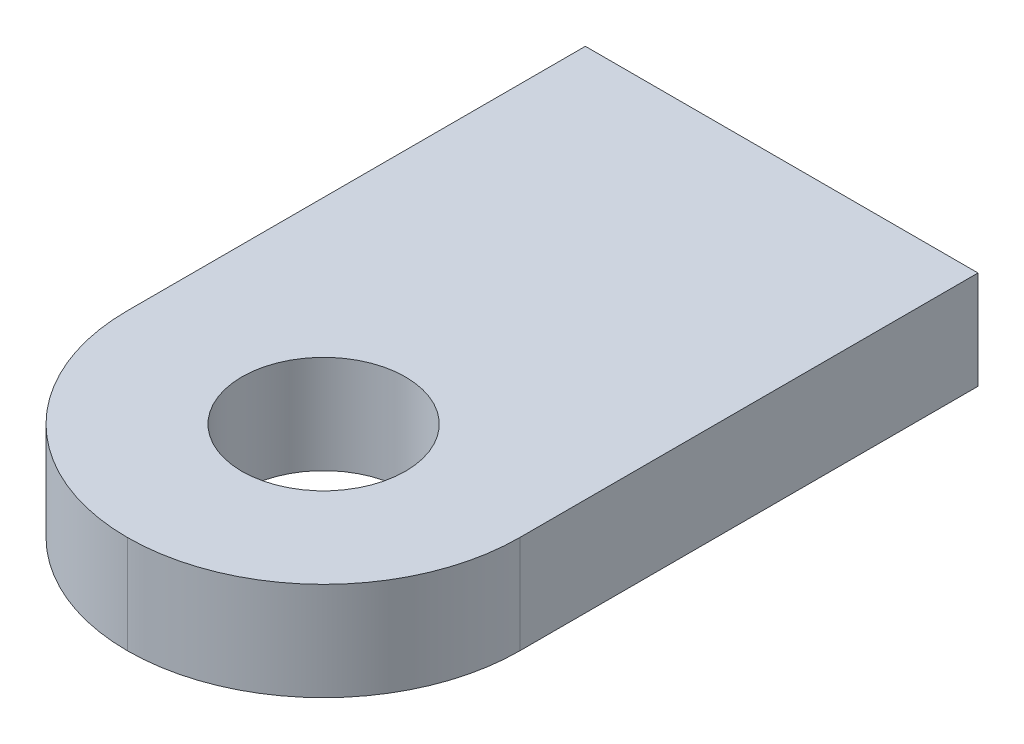
ISO-10303-21;
HEADER;
FILE_DESCRIPTION(('STEP AP214'),'2;1');
FILE_NAME('part.step','',(''),(''),'','','');
FILE_SCHEMA(('AUTOMOTIVE_DESIGN { 1 0 10303 214 1 1 1 1 }'));
ENDSEC;
DATA;
#1=APPLICATION_CONTEXT('core data for automotive mechanical design processes');
#2=APPLICATION_PROTOCOL_DEFINITION('international standard','automotive_design',2000,#1);
#3=PRODUCT_CONTEXT('',#1,'mechanical');
#4=PRODUCT('Part','Part','',(#3));
#5=PRODUCT_RELATED_PRODUCT_CATEGORY('part','',(#4));
#6=PRODUCT_DEFINITION_FORMATION('','',#4);
#7=PRODUCT_DEFINITION_CONTEXT('part definition',#1,'design');
#8=PRODUCT_DEFINITION('design','',#6,#7);
#9=PRODUCT_DEFINITION_SHAPE('','',#8);
#10=(LENGTH_UNIT() NAMED_UNIT(*) SI_UNIT(.MILLI.,.METRE.));
#11=(NAMED_UNIT(*) PLANE_ANGLE_UNIT() SI_UNIT($,.RADIAN.));
#12=(NAMED_UNIT(*) SI_UNIT($,.STERADIAN.) SOLID_ANGLE_UNIT());
#13=UNCERTAINTY_MEASURE_WITH_UNIT(LENGTH_MEASURE(1.E-05),#10,'distance_accuracy_value','');
#14=(GEOMETRIC_REPRESENTATION_CONTEXT(3) GLOBAL_UNCERTAINTY_ASSIGNED_CONTEXT((#13)) GLOBAL_UNIT_ASSIGNED_CONTEXT((#10,
#11,#12)) REPRESENTATION_CONTEXT('',''));
#15=CARTESIAN_POINT('',(0.,0.,0.));
#16=DIRECTION('',(0.,0.,1.));
#17=DIRECTION('',(1.,0.,0.));
#18=AXIS2_PLACEMENT_3D('',#15,#16,#17);
#19=CARTESIAN_POINT('',(0.,0.,5.));
#20=DIRECTION('',(0.,0.,1.));
#21=DIRECTION('',(1.,0.,0.));
#22=AXIS2_PLACEMENT_3D('',#19,#20,#21);
#23=PLANE('',#22);
#24=DIRECTION('',(-1.,0.,0.));
#25=VECTOR('',#24,1.);
#26=CARTESIAN_POINT('',(9.1,-23.5,5.));
#27=LINE('',#26,#25);
#28=CARTESIAN_POINT('',(21.1,-23.5,5.));
#29=VERTEX_POINT('',#28);
#30=CARTESIAN_POINT('',(9.1,-23.5,5.));
#31=VERTEX_POINT('',#30);
#32=EDGE_CURVE('E82',#29,#31,#27,.T.);
#33=ORIENTED_EDGE('',*,*,#32,.F.);
#34=DIRECTION('',(0.,1.,0.));
#35=VECTOR('',#34,1.);
#36=CARTESIAN_POINT('',(21.1,0.,5.));
#37=LINE('',#36,#35);
#38=CARTESIAN_POINT('',(21.1,-26.5,5.));
#39=VERTEX_POINT('',#38);
#40=EDGE_CURVE('E79',#39,#29,#37,.T.);
#41=ORIENTED_EDGE('',*,*,#40,.F.);
#42=DIRECTION('',(1.,0.,0.));
#43=VECTOR('',#42,1.);
#44=CARTESIAN_POINT('',(9.1,-26.5,5.));
#45=LINE('',#44,#43);
#46=CARTESIAN_POINT('',(9.1,-26.5,5.));
#47=VERTEX_POINT('',#46);
#48=EDGE_CURVE('E126',#47,#39,#45,.T.);
#49=ORIENTED_EDGE('',*,*,#48,.F.);
#50=DIRECTION('',(0.,-1.,0.));
#51=VECTOR('',#50,1.);
#52=CARTESIAN_POINT('',(9.1,0.,5.));
#53=LINE('',#52,#51);
#54=EDGE_CURVE('E84',#31,#47,#53,.T.);
#55=ORIENTED_EDGE('',*,*,#54,.F.);
#56=EDGE_LOOP('',(#33,#41,#49,#55));
#57=FACE_BOUND('',#56,.T.);
#58=ADVANCED_FACE('F37',(#57),#23,.F.);
#59=CARTESIAN_POINT('',(9.1,0.,5.));
#60=DIRECTION('',(1.,0.,0.));
#61=DIRECTION('',(0.,1.,0.));
#62=AXIS2_PLACEMENT_3D('',#59,#60,#61);
#63=PLANE('',#62);
#64=DIRECTION('',(0.,0.,-1.));
#65=VECTOR('',#64,1.);
#66=CARTESIAN_POINT('',(9.1,-23.5,25.));
#67=LINE('',#66,#65);
#68=CARTESIAN_POINT('',(9.1,-23.5,19.));
#69=VERTEX_POINT('',#68);
#70=EDGE_CURVE('E108',#69,#31,#67,.T.);
#71=ORIENTED_EDGE('',*,*,#70,.T.);
#72=ORIENTED_EDGE('',*,*,#54,.T.);
#73=DIRECTION('',(0.,0.,-1.));
#74=VECTOR('',#73,1.);
#75=CARTESIAN_POINT('',(9.1,-26.5,5.));
#76=LINE('',#75,#74);
#77=CARTESIAN_POINT('',(9.1,-26.5,19.));
#78=VERTEX_POINT('',#77);
#79=EDGE_CURVE('E114',#78,#47,#76,.T.);
#80=ORIENTED_EDGE('',*,*,#79,.F.);
#81=DIRECTION('',(0.,-1.,0.));
#82=VECTOR('',#81,1.);
#83=CARTESIAN_POINT('',(9.1,0.,19.));
#84=LINE('',#83,#82);
#85=EDGE_CURVE('E125',#78,#69,#84,.F.);
#86=ORIENTED_EDGE('',*,*,#85,.T.);
#87=EDGE_LOOP('',(#71,#72,#80,#86));
#88=FACE_BOUND('',#87,.T.);
#89=ADVANCED_FACE('F153',(#88),#63,.F.);
#90=CARTESIAN_POINT('',(9.1,-26.5,5.));
#91=DIRECTION('',(0.,1.,0.));
#92=DIRECTION('',(0.,0.,1.));
#93=AXIS2_PLACEMENT_3D('',#90,#91,#92);
#94=PLANE('',#93);
#95=CARTESIAN_POINT('',(15.1,-26.5,19.));
#96=DIRECTION('',(0.,1.,0.));
#97=DIRECTION('',(0.,0.,1.));
#98=AXIS2_PLACEMENT_3D('',#95,#96,#97);
#99=CIRCLE('',#98,2.5);
#100=CARTESIAN_POINT('',(15.1,-26.5,21.5));
#101=VERTEX_POINT('',#100);
#102=EDGE_CURVE('E89',#101,#101,#99,.F.);
#103=ORIENTED_EDGE('',*,*,#102,.F.);
#104=EDGE_LOOP('',(#103));
#105=FACE_BOUND('',#104,.T.);
#106=ORIENTED_EDGE('',*,*,#79,.T.);
#107=ORIENTED_EDGE('',*,*,#48,.T.);
#108=DIRECTION('',(0.,0.,-1.));
#109=VECTOR('',#108,1.);
#110=CARTESIAN_POINT('',(21.1,-26.5,5.));
#111=LINE('',#110,#109);
#112=CARTESIAN_POINT('',(21.1,-26.5,19.));
#113=VERTEX_POINT('',#112);
#114=EDGE_CURVE('E97',#113,#39,#111,.T.);
#115=ORIENTED_EDGE('',*,*,#114,.F.);
#116=CARTESIAN_POINT('',(15.1,-26.5,19.));
#117=DIRECTION('',(0.,1.,0.));
#118=DIRECTION('',(0.,0.,1.));
#119=AXIS2_PLACEMENT_3D('',#116,#117,#118);
#120=CIRCLE('',#119,6.);
#121=CARTESIAN_POINT('',(15.1,-26.5,25.));
#122=VERTEX_POINT('',#121);
#123=EDGE_CURVE('E54',#113,#122,#120,.F.);
#124=ORIENTED_EDGE('',*,*,#123,.T.);
#125=CARTESIAN_POINT('',(15.1,-26.5,19.));
#126=DIRECTION('',(0.,1.,0.));
#127=DIRECTION('',(0.,0.,1.));
#128=AXIS2_PLACEMENT_3D('',#125,#126,#127);
#129=CIRCLE('',#128,6.);
#130=EDGE_CURVE('E129',#122,#78,#129,.F.);
#131=ORIENTED_EDGE('',*,*,#130,.T.);
#132=EDGE_LOOP('',(#106,#107,#115,#124,#131));
#133=FACE_BOUND('',#132,.T.);
#134=ADVANCED_FACE('F157',(#105,#133),#94,.F.);
#135=CARTESIAN_POINT('',(21.1,0.,5.));
#136=DIRECTION('',(-1.,0.,0.));
#137=DIRECTION('',(0.,-1.,0.));
#138=AXIS2_PLACEMENT_3D('',#135,#136,#137);
#139=PLANE('',#138);
#140=ORIENTED_EDGE('',*,*,#114,.T.);
#141=ORIENTED_EDGE('',*,*,#40,.T.);
#142=DIRECTION('',(0.,0.,-1.));
#143=VECTOR('',#142,1.);
#144=CARTESIAN_POINT('',(21.1,-23.5,25.));
#145=LINE('',#144,#143);
#146=CARTESIAN_POINT('',(21.1,-23.5,19.));
#147=VERTEX_POINT('',#146);
#148=EDGE_CURVE('E90',#147,#29,#145,.T.);
#149=ORIENTED_EDGE('',*,*,#148,.F.);
#150=DIRECTION('',(0.,1.,0.));
#151=VECTOR('',#150,1.);
#152=CARTESIAN_POINT('',(21.1,0.,19.));
#153=LINE('',#152,#151);
#154=EDGE_CURVE('E98',#147,#113,#153,.F.);
#155=ORIENTED_EDGE('',*,*,#154,.T.);
#156=EDGE_LOOP('',(#140,#141,#149,#155));
#157=FACE_BOUND('',#156,.T.);
#158=ADVANCED_FACE('F95',(#157),#139,.F.);
#159=CARTESIAN_POINT('',(9.1,-23.5,25.));
#160=DIRECTION('',(0.,-1.,0.));
#161=DIRECTION('',(0.,0.,-1.));
#162=AXIS2_PLACEMENT_3D('',#159,#160,#161);
#163=PLANE('',#162);
#164=CARTESIAN_POINT('',(15.1,-23.5,19.));
#165=DIRECTION('',(0.,1.,0.));
#166=DIRECTION('',(0.,0.,1.));
#167=AXIS2_PLACEMENT_3D('',#164,#165,#166);
#168=CIRCLE('',#167,2.5);
#169=CARTESIAN_POINT('',(15.1,-23.5,21.5));
#170=VERTEX_POINT('',#169);
#171=EDGE_CURVE('E46',#170,#170,#168,.T.);
#172=ORIENTED_EDGE('',*,*,#171,.F.);
#173=EDGE_LOOP('',(#172));
#174=FACE_BOUND('',#173,.T.);
#175=CARTESIAN_POINT('',(15.1,-23.5,19.));
#176=DIRECTION('',(0.,-1.,0.));
#177=DIRECTION('',(0.,0.,-1.));
#178=AXIS2_PLACEMENT_3D('',#175,#176,#177);
#179=CIRCLE('',#178,6.);
#180=CARTESIAN_POINT('',(15.1,-23.5,25.));
#181=VERTEX_POINT('',#180);
#182=EDGE_CURVE('E103',#69,#181,#179,.F.);
#183=ORIENTED_EDGE('',*,*,#182,.T.);
#184=CARTESIAN_POINT('',(15.1,-23.5,19.));
#185=DIRECTION('',(0.,-1.,0.));
#186=DIRECTION('',(0.,0.,-1.));
#187=AXIS2_PLACEMENT_3D('',#184,#185,#186);
#188=CIRCLE('',#187,6.);
#189=EDGE_CURVE('E101',#181,#147,#188,.F.);
#190=ORIENTED_EDGE('',*,*,#189,.T.);
#191=ORIENTED_EDGE('',*,*,#148,.T.);
#192=ORIENTED_EDGE('',*,*,#32,.T.);
#193=ORIENTED_EDGE('',*,*,#70,.F.);
#194=EDGE_LOOP('',(#183,#190,#191,#192,#193));
#195=FACE_BOUND('',#194,.T.);
#196=ADVANCED_FACE('F99',(#174,#195),#163,.F.);
#197=CARTESIAN_POINT('',(15.1,-33.5710678118655,19.));
#198=DIRECTION('',(0.,1.,0.));
#199=DIRECTION('',(0.,0.,1.));
#200=AXIS2_PLACEMENT_3D('',#197,#198,#199);
#201=CYLINDRICAL_SURFACE('',#200,2.5);
#202=ORIENTED_EDGE('',*,*,#102,.T.);
#203=EDGE_LOOP('',(#202));
#204=FACE_BOUND('',#203,.T.);
#205=ORIENTED_EDGE('',*,*,#171,.T.);
#206=EDGE_LOOP('',(#205));
#207=FACE_BOUND('',#206,.T.);
#208=ADVANCED_FACE('F149',(#204,#207),#201,.F.);
#209=CARTESIAN_POINT('',(15.1,0.,19.));
#210=DIRECTION('',(0.,-1.,0.));
#211=DIRECTION('',(1.,0.,0.));
#212=AXIS2_PLACEMENT_3D('',#209,#210,#211);
#213=CYLINDRICAL_SURFACE('',#212,6.);
#214=ORIENTED_EDGE('',*,*,#85,.F.);
#215=ORIENTED_EDGE('',*,*,#130,.F.);
#216=DIRECTION('',(0.,-1.,0.));
#217=VECTOR('',#216,1.);
#218=CARTESIAN_POINT('',(15.1,0.,25.));
#219=LINE('',#218,#217);
#220=EDGE_CURVE('E12',#181,#122,#219,.T.);
#221=ORIENTED_EDGE('',*,*,#220,.F.);
#222=ORIENTED_EDGE('',*,*,#182,.F.);
#223=EDGE_LOOP('',(#214,#215,#221,#222));
#224=FACE_BOUND('',#223,.T.);
#225=ADVANCED_FACE('F142',(#224),#213,.T.);
#226=CARTESIAN_POINT('',(15.1,0.,19.));
#227=DIRECTION('',(0.,1.,0.));
#228=DIRECTION('',(-1.,0.,0.));
#229=AXIS2_PLACEMENT_3D('',#226,#227,#228);
#230=CYLINDRICAL_SURFACE('',#229,6.);
#231=ORIENTED_EDGE('',*,*,#123,.F.);
#232=ORIENTED_EDGE('',*,*,#154,.F.);
#233=ORIENTED_EDGE('',*,*,#189,.F.);
#234=ORIENTED_EDGE('',*,*,#220,.T.);
#235=EDGE_LOOP('',(#231,#232,#233,#234));
#236=FACE_BOUND('',#235,.T.);
#237=ADVANCED_FACE('F143',(#236),#230,.T.);
#238=CLOSED_SHELL('',(#58,#89,#134,#158,#196,#208,#225,#237));
#239=MANIFOLD_SOLID_BREP('B2',#238);
#240=ADVANCED_BREP_SHAPE_REPRESENTATION('',(#18,#239),#14);
#241=SHAPE_DEFINITION_REPRESENTATION(#9,#240);
ENDSEC;
END-ISO-10303-21;
